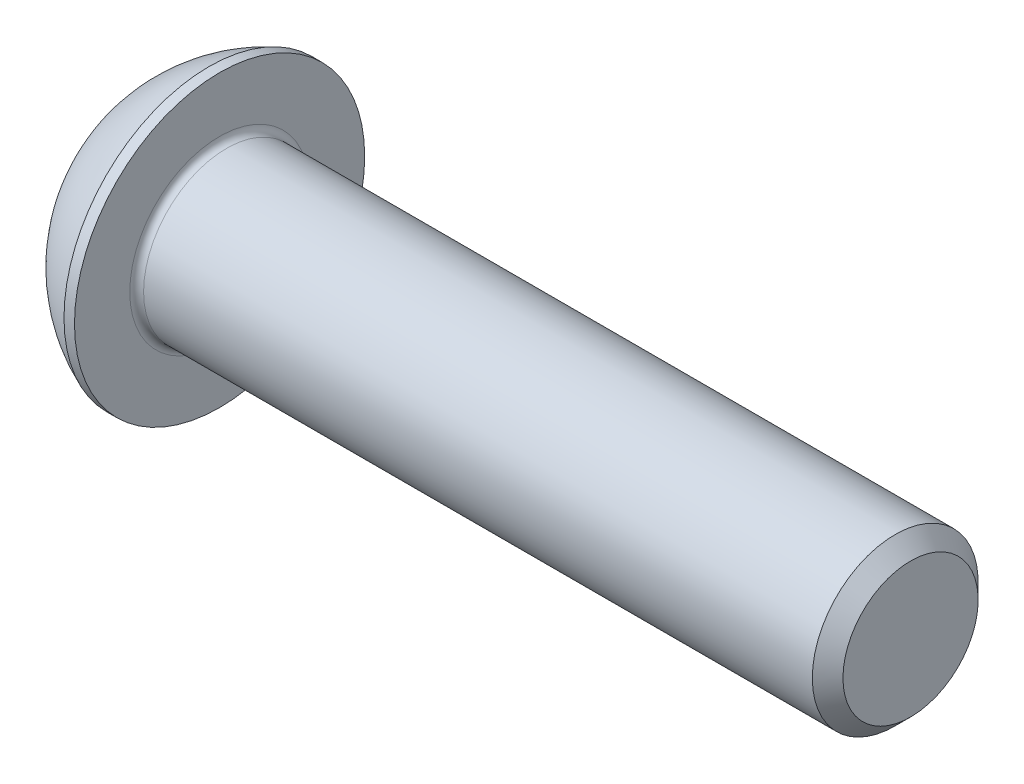
ISO-10303-21;
HEADER;
FILE_DESCRIPTION(('STEP AP214'),'2;1');
FILE_NAME('part.step','',(''),(''),'','','');
FILE_SCHEMA(('AUTOMOTIVE_DESIGN { 1 0 10303 214 1 1 1 1 }'));
ENDSEC;
DATA;
#1=APPLICATION_CONTEXT('core data for automotive mechanical design processes');
#2=APPLICATION_PROTOCOL_DEFINITION('international standard','automotive_design',2000,#1);
#3=PRODUCT_CONTEXT('',#1,'mechanical');
#4=PRODUCT('Part','Part','',(#3));
#5=PRODUCT_RELATED_PRODUCT_CATEGORY('part','',(#4));
#6=PRODUCT_DEFINITION_FORMATION('','',#4);
#7=PRODUCT_DEFINITION_CONTEXT('part definition',#1,'design');
#8=PRODUCT_DEFINITION('design','',#6,#7);
#9=PRODUCT_DEFINITION_SHAPE('','',#8);
#10=(LENGTH_UNIT() NAMED_UNIT(*) SI_UNIT(.MILLI.,.METRE.));
#11=(NAMED_UNIT(*) PLANE_ANGLE_UNIT() SI_UNIT($,.RADIAN.));
#12=(NAMED_UNIT(*) SI_UNIT($,.STERADIAN.) SOLID_ANGLE_UNIT());
#13=UNCERTAINTY_MEASURE_WITH_UNIT(LENGTH_MEASURE(1.E-05),#10,'distance_accuracy_value','');
#14=(GEOMETRIC_REPRESENTATION_CONTEXT(3) GLOBAL_UNCERTAINTY_ASSIGNED_CONTEXT((#13)) GLOBAL_UNIT_ASSIGNED_CONTEXT((#10,
#11,#12)) REPRESENTATION_CONTEXT('',''));
#15=CARTESIAN_POINT('',(0.,0.,0.));
#16=DIRECTION('',(0.,0.,1.));
#17=DIRECTION('',(1.,0.,0.));
#18=AXIS2_PLACEMENT_3D('',#15,#16,#17);
#19=CARTESIAN_POINT('',(0.,0.,0.));
#20=DIRECTION('',(-1.,0.,0.));
#21=DIRECTION('',(0.,0.,1.));
#22=AXIS2_PLACEMENT_3D('',#19,#20,#21);
#23=PLANE('',#22);
#24=CARTESIAN_POINT('',(0.,0.,0.));
#25=DIRECTION('',(-1.,0.,0.));
#26=DIRECTION('',(0.,0.,1.));
#27=AXIS2_PLACEMENT_3D('',#24,#25,#26);
#28=CIRCLE('',#27,2.625);
#29=CARTESIAN_POINT('',(0.,0.,2.625));
#30=VERTEX_POINT('',#29);
#31=EDGE_CURVE('E155',#30,#30,#28,.T.);
#32=ORIENTED_EDGE('',*,*,#31,.T.);
#33=EDGE_LOOP('',(#32));
#34=FACE_BOUND('',#33,.T.);
#35=DIRECTION('',(0.,-1.,0.));
#36=VECTOR('',#35,1.);
#37=CARTESIAN_POINT('',(0.,-1.15470053837925,2.));
#38=LINE('',#37,#36);
#39=CARTESIAN_POINT('',(0.,1.15470053837925,2.));
#40=VERTEX_POINT('',#39);
#41=CARTESIAN_POINT('',(0.,-1.15470053837925,2.));
#42=VERTEX_POINT('',#41);
#43=EDGE_CURVE('E50',#40,#42,#38,.T.);
#44=ORIENTED_EDGE('',*,*,#43,.T.);
#45=DIRECTION('',(0.,-0.5,-0.866025403784438));
#46=VECTOR('',#45,1.);
#47=CARTESIAN_POINT('',(0.,-2.3094010767585,0.));
#48=LINE('',#47,#46);
#49=CARTESIAN_POINT('',(0.,-2.3094010767585,0.));
#50=VERTEX_POINT('',#49);
#51=EDGE_CURVE('E275',#42,#50,#48,.T.);
#52=ORIENTED_EDGE('',*,*,#51,.T.);
#53=DIRECTION('',(0.,0.5,-0.866025403784439));
#54=VECTOR('',#53,1.);
#55=CARTESIAN_POINT('',(0.,-1.15470053837925,-2.));
#56=LINE('',#55,#54);
#57=CARTESIAN_POINT('',(0.,-1.15470053837925,-2.));
#58=VERTEX_POINT('',#57);
#59=EDGE_CURVE('E130',#50,#58,#56,.T.);
#60=ORIENTED_EDGE('',*,*,#59,.T.);
#61=DIRECTION('',(0.,1.,0.));
#62=VECTOR('',#61,1.);
#63=CARTESIAN_POINT('',(0.,1.15470053837925,-2.));
#64=LINE('',#63,#62);
#65=CARTESIAN_POINT('',(0.,1.15470053837925,-2.));
#66=VERTEX_POINT('',#65);
#67=EDGE_CURVE('E278',#58,#66,#64,.T.);
#68=ORIENTED_EDGE('',*,*,#67,.T.);
#69=DIRECTION('',(0.,0.5,0.866025403784439));
#70=VECTOR('',#69,1.);
#71=CARTESIAN_POINT('',(0.,2.3094010767585,0.));
#72=LINE('',#71,#70);
#73=CARTESIAN_POINT('',(0.,2.3094010767585,0.));
#74=VERTEX_POINT('',#73);
#75=EDGE_CURVE('E280',#66,#74,#72,.T.);
#76=ORIENTED_EDGE('',*,*,#75,.T.);
#77=DIRECTION('',(0.,-0.5,0.866025403784439));
#78=VECTOR('',#77,1.);
#79=CARTESIAN_POINT('',(0.,1.15470053837925,2.));
#80=LINE('',#79,#78);
#81=EDGE_CURVE('E282',#74,#40,#80,.T.);
#82=ORIENTED_EDGE('',*,*,#81,.T.);
#83=EDGE_LOOP('',(#44,#52,#60,#68,#76,#82));
#84=FACE_BOUND('',#83,.T.);
#85=ADVANCED_FACE('F35',(#34,#84),#23,.T.);
#86=CARTESIAN_POINT('',(4.99970462328768,0.,0.));
#87=DIRECTION('',(-1.,0.,0.));
#88=DIRECTION('',(0.,1.,0.));
#89=AXIS2_PLACEMENT_3D('',#86,#87,#88);
#90=SPHERICAL_SURFACE('',#89,5.64691697478581);
#91=CARTESIAN_POINT('',(2.92,0.,0.));
#92=DIRECTION('',(-1.,0.,0.));
#93=DIRECTION('',(0.,0.,1.));
#94=AXIS2_PLACEMENT_3D('',#91,#92,#93);
#95=CIRCLE('',#94,5.25);
#96=CARTESIAN_POINT('',(2.92,0.,5.25));
#97=VERTEX_POINT('',#96);
#98=EDGE_CURVE('E152',#97,#97,#95,.T.);
#99=ORIENTED_EDGE('',*,*,#98,.T.);
#100=EDGE_LOOP('',(#99));
#101=FACE_BOUND('',#100,.T.);
#102=ORIENTED_EDGE('',*,*,#31,.F.);
#103=EDGE_LOOP('',(#102));
#104=FACE_BOUND('',#103,.T.);
#105=ADVANCED_FACE('F176',(#101,#104),#90,.T.);
#106=CARTESIAN_POINT('',(0.,0.,0.));
#107=DIRECTION('',(-1.,0.,0.));
#108=DIRECTION('',(0.,0.,1.));
#109=AXIS2_PLACEMENT_3D('',#106,#107,#108);
#110=CYLINDRICAL_SURFACE('',#109,5.25);
#111=ORIENTED_EDGE('',*,*,#98,.F.);
#112=EDGE_LOOP('',(#111));
#113=FACE_BOUND('',#112,.T.);
#114=CARTESIAN_POINT('',(3.3,0.,0.));
#115=DIRECTION('',(-1.,0.,0.));
#116=DIRECTION('',(0.,0.,1.));
#117=AXIS2_PLACEMENT_3D('',#114,#115,#116);
#118=CIRCLE('',#117,5.25);
#119=CARTESIAN_POINT('',(3.3,0.,5.25));
#120=VERTEX_POINT('',#119);
#121=EDGE_CURVE('E149',#120,#120,#118,.T.);
#122=ORIENTED_EDGE('',*,*,#121,.T.);
#123=EDGE_LOOP('',(#122));
#124=FACE_BOUND('',#123,.T.);
#125=ADVANCED_FACE('F181',(#113,#124),#110,.T.);
#126=CARTESIAN_POINT('',(3.3,3.,0.));
#127=DIRECTION('',(-1.,0.,0.));
#128=DIRECTION('',(0.,0.,1.));
#129=AXIS2_PLACEMENT_3D('',#126,#127,#128);
#130=PLANE('',#129);
#131=CARTESIAN_POINT('',(3.3,0.,0.));
#132=DIRECTION('',(-1.,0.,0.));
#133=DIRECTION('',(0.,0.,1.));
#134=AXIS2_PLACEMENT_3D('',#131,#132,#133);
#135=CIRCLE('',#134,3.25);
#136=CARTESIAN_POINT('',(3.3,0.,3.25));
#137=VERTEX_POINT('',#136);
#138=EDGE_CURVE('E43',#137,#137,#135,.T.);
#139=ORIENTED_EDGE('',*,*,#138,.T.);
#140=EDGE_LOOP('',(#139));
#141=FACE_BOUND('',#140,.T.);
#142=ORIENTED_EDGE('',*,*,#121,.F.);
#143=EDGE_LOOP('',(#142));
#144=FACE_BOUND('',#143,.T.);
#145=ADVANCED_FACE('F160',(#141,#144),#130,.F.);
#146=CARTESIAN_POINT('',(0.,0.,0.));
#147=DIRECTION('',(-1.,0.,0.));
#148=DIRECTION('',(0.,0.,1.));
#149=AXIS2_PLACEMENT_3D('',#146,#147,#148);
#150=CYLINDRICAL_SURFACE('',#149,3.);
#151=CARTESIAN_POINT('',(3.55,0.,0.));
#152=DIRECTION('',(-1.,0.,0.));
#153=DIRECTION('',(0.,0.,1.));
#154=AXIS2_PLACEMENT_3D('',#151,#152,#153);
#155=CIRCLE('',#154,3.);
#156=CARTESIAN_POINT('',(3.55,0.,3.));
#157=VERTEX_POINT('',#156);
#158=EDGE_CURVE('E11',#157,#157,#155,.F.);
#159=ORIENTED_EDGE('',*,*,#158,.T.);
#160=EDGE_LOOP('',(#159));
#161=FACE_BOUND('',#160,.T.);
#162=CARTESIAN_POINT('',(27.7455,0.,0.));
#163=DIRECTION('',(-1.,0.,0.));
#164=DIRECTION('',(0.,0.,1.));
#165=AXIS2_PLACEMENT_3D('',#162,#163,#164);
#166=CIRCLE('',#165,3.);
#167=CARTESIAN_POINT('',(27.7455,0.,3.));
#168=VERTEX_POINT('',#167);
#169=EDGE_CURVE('E146',#168,#168,#166,.T.);
#170=ORIENTED_EDGE('',*,*,#169,.T.);
#171=EDGE_LOOP('',(#170));
#172=FACE_BOUND('',#171,.T.);
#173=ADVANCED_FACE('F190',(#161,#172),#150,.T.);
#174=CARTESIAN_POINT('',(28.3,0.,0.));
#175=DIRECTION('',(-1.,0.,0.));
#176=DIRECTION('',(0.,0.,1.));
#177=AXIS2_PLACEMENT_3D('',#174,#175,#176);
#178=CONICAL_SURFACE('',#177,2.4455,0.785398163397437);
#179=ORIENTED_EDGE('',*,*,#169,.F.);
#180=EDGE_LOOP('',(#179));
#181=FACE_BOUND('',#180,.T.);
#182=CARTESIAN_POINT('',(28.3,0.,0.));
#183=DIRECTION('',(-1.,0.,0.));
#184=DIRECTION('',(0.,0.,1.));
#185=AXIS2_PLACEMENT_3D('',#182,#183,#184);
#186=CIRCLE('',#185,2.4455);
#187=CARTESIAN_POINT('',(28.3,0.,2.4455));
#188=VERTEX_POINT('',#187);
#189=EDGE_CURVE('E142',#188,#188,#186,.T.);
#190=ORIENTED_EDGE('',*,*,#189,.T.);
#191=EDGE_LOOP('',(#190));
#192=FACE_BOUND('',#191,.T.);
#193=ADVANCED_FACE('F171',(#181,#192),#178,.T.);
#194=CARTESIAN_POINT('',(28.3,0.,0.));
#195=DIRECTION('',(-1.,0.,0.));
#196=DIRECTION('',(0.,0.,1.));
#197=AXIS2_PLACEMENT_3D('',#194,#195,#196);
#198=PLANE('',#197);
#199=ORIENTED_EDGE('',*,*,#189,.F.);
#200=EDGE_LOOP('',(#199));
#201=FACE_BOUND('',#200,.T.);
#202=ADVANCED_FACE('F164',(#201),#198,.F.);
#203=CARTESIAN_POINT('',(3.55,0.,0.));
#204=DIRECTION('',(-1.,0.,0.));
#205=DIRECTION('',(0.,0.,1.));
#206=AXIS2_PLACEMENT_3D('',#203,#204,#205);
#207=TOROIDAL_SURFACE('',#206,3.25,0.25);
#208=ORIENTED_EDGE('',*,*,#158,.F.);
#209=EDGE_LOOP('',(#208));
#210=FACE_BOUND('',#209,.T.);
#211=ORIENTED_EDGE('',*,*,#138,.F.);
#212=EDGE_LOOP('',(#211));
#213=FACE_BOUND('',#212,.T.);
#214=ADVANCED_FACE('F37',(#210,#213),#207,.F.);
#215=CARTESIAN_POINT('',(2.08,-2.3094010767585,0.));
#216=DIRECTION('',(0.,0.866025403784438,-0.5));
#217=DIRECTION('',(0.,0.5,0.866025403784438));
#218=AXIS2_PLACEMENT_3D('',#215,#216,#217);
#219=PLANE('',#218);
#220=DIRECTION('',(0.,-0.5,-0.866025403784438));
#221=VECTOR('',#220,1.);
#222=CARTESIAN_POINT('',(2.08,-2.3094010767585,0.));
#223=LINE('',#222,#221);
#224=CARTESIAN_POINT('',(2.08,-1.15470053837925,2.));
#225=VERTEX_POINT('',#224);
#226=CARTESIAN_POINT('',(2.08,-1.73205080756888,1.));
#227=VERTEX_POINT('',#226);
#228=EDGE_CURVE('E116',#225,#227,#223,.T.);
#229=ORIENTED_EDGE('',*,*,#228,.T.);
#230=CARTESIAN_POINT('',(2.08,-2.3094010767585,0.));
#231=VERTEX_POINT('',#230);
#232=EDGE_CURVE('E111',#227,#231,#223,.T.);
#233=ORIENTED_EDGE('',*,*,#232,.T.);
#234=DIRECTION('',(-1.,0.,0.));
#235=VECTOR('',#234,1.);
#236=CARTESIAN_POINT('',(2.08,-2.3094010767585,0.));
#237=LINE('',#236,#235);
#238=EDGE_CURVE('E113',#231,#50,#237,.T.);
#239=ORIENTED_EDGE('',*,*,#238,.T.);
#240=ORIENTED_EDGE('',*,*,#51,.F.);
#241=DIRECTION('',(-1.,0.,0.));
#242=VECTOR('',#241,1.);
#243=CARTESIAN_POINT('',(2.08,-1.15470053837925,2.));
#244=LINE('',#243,#242);
#245=EDGE_CURVE('E271',#225,#42,#244,.T.);
#246=ORIENTED_EDGE('',*,*,#245,.F.);
#247=EDGE_LOOP('',(#229,#233,#239,#240,#246));
#248=FACE_BOUND('',#247,.T.);
#249=ADVANCED_FACE('F112',(#248),#219,.T.);
#250=CARTESIAN_POINT('',(2.08,-1.15470053837925,-2.));
#251=DIRECTION('',(0.,0.866025403784438,0.5));
#252=DIRECTION('',(0.,-0.5,0.866025403784439));
#253=AXIS2_PLACEMENT_3D('',#250,#251,#252);
#254=PLANE('',#253);
#255=DIRECTION('',(0.,0.5,-0.866025403784439));
#256=VECTOR('',#255,1.);
#257=CARTESIAN_POINT('',(2.08,-1.15470053837925,-2.));
#258=LINE('',#257,#256);
#259=CARTESIAN_POINT('',(2.08,-1.73205080756888,-1.));
#260=VERTEX_POINT('',#259);
#261=EDGE_CURVE('E58',#231,#260,#258,.T.);
#262=ORIENTED_EDGE('',*,*,#261,.T.);
#263=CARTESIAN_POINT('',(2.08,-1.15470053837925,-2.));
#264=VERTEX_POINT('',#263);
#265=EDGE_CURVE('E125',#260,#264,#258,.T.);
#266=ORIENTED_EDGE('',*,*,#265,.T.);
#267=DIRECTION('',(-1.,0.,0.));
#268=VECTOR('',#267,1.);
#269=CARTESIAN_POINT('',(2.08,-1.15470053837925,-2.));
#270=LINE('',#269,#268);
#271=EDGE_CURVE('E132',#264,#58,#270,.T.);
#272=ORIENTED_EDGE('',*,*,#271,.T.);
#273=ORIENTED_EDGE('',*,*,#59,.F.);
#274=ORIENTED_EDGE('',*,*,#238,.F.);
#275=EDGE_LOOP('',(#262,#266,#272,#273,#274));
#276=FACE_BOUND('',#275,.T.);
#277=ADVANCED_FACE('F128',(#276),#254,.T.);
#278=CARTESIAN_POINT('',(2.08,1.15470053837925,-2.));
#279=DIRECTION('',(0.,0.,1.));
#280=DIRECTION('',(1.,0.,0.));
#281=AXIS2_PLACEMENT_3D('',#278,#279,#280);
#282=PLANE('',#281);
#283=DIRECTION('',(0.,1.,0.));
#284=VECTOR('',#283,1.);
#285=CARTESIAN_POINT('',(2.08,1.15470053837925,-2.));
#286=LINE('',#285,#284);
#287=CARTESIAN_POINT('',(2.08,0.,-2.));
#288=VERTEX_POINT('',#287);
#289=EDGE_CURVE('E252',#264,#288,#286,.T.);
#290=ORIENTED_EDGE('',*,*,#289,.T.);
#291=CARTESIAN_POINT('',(2.08,1.15470053837925,-2.));
#292=VERTEX_POINT('',#291);
#293=EDGE_CURVE('E124',#288,#292,#286,.T.);
#294=ORIENTED_EDGE('',*,*,#293,.T.);
#295=DIRECTION('',(-1.,0.,0.));
#296=VECTOR('',#295,1.);
#297=CARTESIAN_POINT('',(2.08,1.15470053837925,-2.));
#298=LINE('',#297,#296);
#299=EDGE_CURVE('E137',#292,#66,#298,.T.);
#300=ORIENTED_EDGE('',*,*,#299,.T.);
#301=ORIENTED_EDGE('',*,*,#67,.F.);
#302=ORIENTED_EDGE('',*,*,#271,.F.);
#303=EDGE_LOOP('',(#290,#294,#300,#301,#302));
#304=FACE_BOUND('',#303,.T.);
#305=ADVANCED_FACE('F204',(#304),#282,.T.);
#306=CARTESIAN_POINT('',(2.08,2.3094010767585,0.));
#307=DIRECTION('',(0.,-0.866025403784439,0.5));
#308=DIRECTION('',(0.,-0.5,-0.866025403784439));
#309=AXIS2_PLACEMENT_3D('',#306,#307,#308);
#310=PLANE('',#309);
#311=DIRECTION('',(0.,0.5,0.866025403784439));
#312=VECTOR('',#311,1.);
#313=CARTESIAN_POINT('',(2.08,2.3094010767585,0.));
#314=LINE('',#313,#312);
#315=CARTESIAN_POINT('',(2.08,1.73205080756888,-1.));
#316=VERTEX_POINT('',#315);
#317=EDGE_CURVE('E241',#292,#316,#314,.T.);
#318=ORIENTED_EDGE('',*,*,#317,.T.);
#319=CARTESIAN_POINT('',(2.08,2.3094010767585,0.));
#320=VERTEX_POINT('',#319);
#321=EDGE_CURVE('E246',#316,#320,#314,.T.);
#322=ORIENTED_EDGE('',*,*,#321,.T.);
#323=DIRECTION('',(-1.,0.,0.));
#324=VECTOR('',#323,1.);
#325=CARTESIAN_POINT('',(2.08,2.3094010767585,0.));
#326=LINE('',#325,#324);
#327=EDGE_CURVE('E286',#320,#74,#326,.T.);
#328=ORIENTED_EDGE('',*,*,#327,.T.);
#329=ORIENTED_EDGE('',*,*,#75,.F.);
#330=ORIENTED_EDGE('',*,*,#299,.F.);
#331=EDGE_LOOP('',(#318,#322,#328,#329,#330));
#332=FACE_BOUND('',#331,.T.);
#333=ADVANCED_FACE('F207',(#332),#310,.T.);
#334=CARTESIAN_POINT('',(2.08,1.15470053837925,2.));
#335=DIRECTION('',(0.,-0.866025403784439,-0.5));
#336=DIRECTION('',(0.,0.5,-0.866025403784439));
#337=AXIS2_PLACEMENT_3D('',#334,#335,#336);
#338=PLANE('',#337);
#339=DIRECTION('',(0.,-0.5,0.866025403784439));
#340=VECTOR('',#339,1.);
#341=CARTESIAN_POINT('',(2.08,1.15470053837925,2.));
#342=LINE('',#341,#340);
#343=CARTESIAN_POINT('',(2.08,1.73205080756888,1.));
#344=VERTEX_POINT('',#343);
#345=EDGE_CURVE('E249',#320,#344,#342,.T.);
#346=ORIENTED_EDGE('',*,*,#345,.T.);
#347=CARTESIAN_POINT('',(2.08,1.15470053837925,2.));
#348=VERTEX_POINT('',#347);
#349=EDGE_CURVE('E257',#344,#348,#342,.T.);
#350=ORIENTED_EDGE('',*,*,#349,.T.);
#351=DIRECTION('',(-1.,0.,0.));
#352=VECTOR('',#351,1.);
#353=CARTESIAN_POINT('',(2.08,1.15470053837925,2.));
#354=LINE('',#353,#352);
#355=EDGE_CURVE('E270',#348,#40,#354,.T.);
#356=ORIENTED_EDGE('',*,*,#355,.T.);
#357=ORIENTED_EDGE('',*,*,#81,.F.);
#358=ORIENTED_EDGE('',*,*,#327,.F.);
#359=EDGE_LOOP('',(#346,#350,#356,#357,#358));
#360=FACE_BOUND('',#359,.T.);
#361=ADVANCED_FACE('F211',(#360),#338,.T.);
#362=CARTESIAN_POINT('',(2.08,-1.15470053837925,2.));
#363=DIRECTION('',(0.,0.,-1.));
#364=DIRECTION('',(-1.,0.,0.));
#365=AXIS2_PLACEMENT_3D('',#362,#363,#364);
#366=PLANE('',#365);
#367=DIRECTION('',(0.,-1.,0.));
#368=VECTOR('',#367,1.);
#369=CARTESIAN_POINT('',(2.08,-1.15470053837925,2.));
#370=LINE('',#369,#368);
#371=CARTESIAN_POINT('',(2.08,0.,2.));
#372=VERTEX_POINT('',#371);
#373=EDGE_CURVE('E263',#348,#372,#370,.T.);
#374=ORIENTED_EDGE('',*,*,#373,.T.);
#375=EDGE_CURVE('E265',#372,#225,#370,.T.);
#376=ORIENTED_EDGE('',*,*,#375,.T.);
#377=ORIENTED_EDGE('',*,*,#245,.T.);
#378=ORIENTED_EDGE('',*,*,#43,.F.);
#379=ORIENTED_EDGE('',*,*,#355,.F.);
#380=EDGE_LOOP('',(#374,#376,#377,#378,#379));
#381=FACE_BOUND('',#380,.T.);
#382=ADVANCED_FACE('F215',(#381),#366,.T.);
#383=CARTESIAN_POINT('',(2.08,-2.3094010767585,0.));
#384=DIRECTION('',(1.,0.,0.));
#385=DIRECTION('',(0.,0.,-1.));
#386=AXIS2_PLACEMENT_3D('',#383,#384,#385);
#387=PLANE('',#386);
#388=CARTESIAN_POINT('',(2.08,0.,0.));
#389=DIRECTION('',(-1.,0.,0.));
#390=DIRECTION('',(0.,0.,1.));
#391=AXIS2_PLACEMENT_3D('',#388,#389,#390);
#392=CIRCLE('',#391,2.);
#393=EDGE_CURVE('E238',#316,#288,#392,.T.);
#394=ORIENTED_EDGE('',*,*,#393,.F.);
#395=ORIENTED_EDGE('',*,*,#317,.F.);
#396=ORIENTED_EDGE('',*,*,#293,.F.);
#397=EDGE_LOOP('',(#394,#395,#396));
#398=FACE_BOUND('',#397,.T.);
#399=ADVANCED_FACE('F219',(#398),#387,.F.);
#400=EDGE_CURVE('E143',#344,#316,#392,.T.);
#401=ORIENTED_EDGE('',*,*,#400,.F.);
#402=ORIENTED_EDGE('',*,*,#345,.F.);
#403=ORIENTED_EDGE('',*,*,#321,.F.);
#404=EDGE_LOOP('',(#401,#402,#403));
#405=FACE_BOUND('',#404,.T.);
#406=ADVANCED_FACE('F228',(#405),#387,.F.);
#407=EDGE_CURVE('E136',#372,#344,#392,.T.);
#408=ORIENTED_EDGE('',*,*,#407,.F.);
#409=ORIENTED_EDGE('',*,*,#373,.F.);
#410=ORIENTED_EDGE('',*,*,#349,.F.);
#411=EDGE_LOOP('',(#408,#409,#410));
#412=FACE_BOUND('',#411,.T.);
#413=ADVANCED_FACE('F233',(#412),#387,.F.);
#414=EDGE_CURVE('E131',#227,#372,#392,.T.);
#415=ORIENTED_EDGE('',*,*,#414,.F.);
#416=ORIENTED_EDGE('',*,*,#228,.F.);
#417=ORIENTED_EDGE('',*,*,#375,.F.);
#418=EDGE_LOOP('',(#415,#416,#417));
#419=FACE_BOUND('',#418,.T.);
#420=ADVANCED_FACE('F226',(#419),#387,.F.);
#421=EDGE_CURVE('E122',#260,#227,#392,.T.);
#422=ORIENTED_EDGE('',*,*,#421,.F.);
#423=ORIENTED_EDGE('',*,*,#261,.F.);
#424=ORIENTED_EDGE('',*,*,#232,.F.);
#425=EDGE_LOOP('',(#422,#423,#424));
#426=FACE_BOUND('',#425,.T.);
#427=ADVANCED_FACE('F121',(#426),#387,.F.);
#428=EDGE_CURVE('E244',#288,#260,#392,.T.);
#429=ORIENTED_EDGE('',*,*,#428,.F.);
#430=ORIENTED_EDGE('',*,*,#289,.F.);
#431=ORIENTED_EDGE('',*,*,#265,.F.);
#432=EDGE_LOOP('',(#429,#430,#431));
#433=FACE_BOUND('',#432,.T.);
#434=ADVANCED_FACE('F199',(#433),#387,.F.);
#435=CARTESIAN_POINT('',(3.23470053837926,0.,0.));
#436=DIRECTION('',(-1.,0.,0.));
#437=DIRECTION('',(0.,0.,1.));
#438=AXIS2_PLACEMENT_3D('',#435,#436,#437);
#439=CONICAL_SURFACE('',#438,0.,1.04719755119659);
#440=ORIENTED_EDGE('',*,*,#407,.T.);
#441=ORIENTED_EDGE('',*,*,#400,.T.);
#442=ORIENTED_EDGE('',*,*,#393,.T.);
#443=ORIENTED_EDGE('',*,*,#428,.T.);
#444=ORIENTED_EDGE('',*,*,#421,.T.);
#445=ORIENTED_EDGE('',*,*,#414,.T.);
#446=EDGE_LOOP('',(#440,#441,#442,#443,#444,#445));
#447=FACE_BOUND('',#446,.T.);
#448=CARTESIAN_POINT('',(3.23470053837926,0.,0.));
#449=VERTEX_POINT('',#448);
#450=VERTEX_LOOP('',#449);
#451=FACE_BOUND('',#450,.T.);
#452=ADVANCED_FACE('F197',(#447,#451),#439,.F.);
#453=CLOSED_SHELL('',(#85,#105,#125,#145,#173,#193,#202,#214,#249,#277,#305,#333,#361,#382,#399,
#406,#413,#420,#427,#434,#452));
#454=MANIFOLD_SOLID_BREP('B2',#453);
#455=ADVANCED_BREP_SHAPE_REPRESENTATION('',(#18,#454),#14);
#456=SHAPE_DEFINITION_REPRESENTATION(#9,#455);
ENDSEC;
END-ISO-10303-21;
